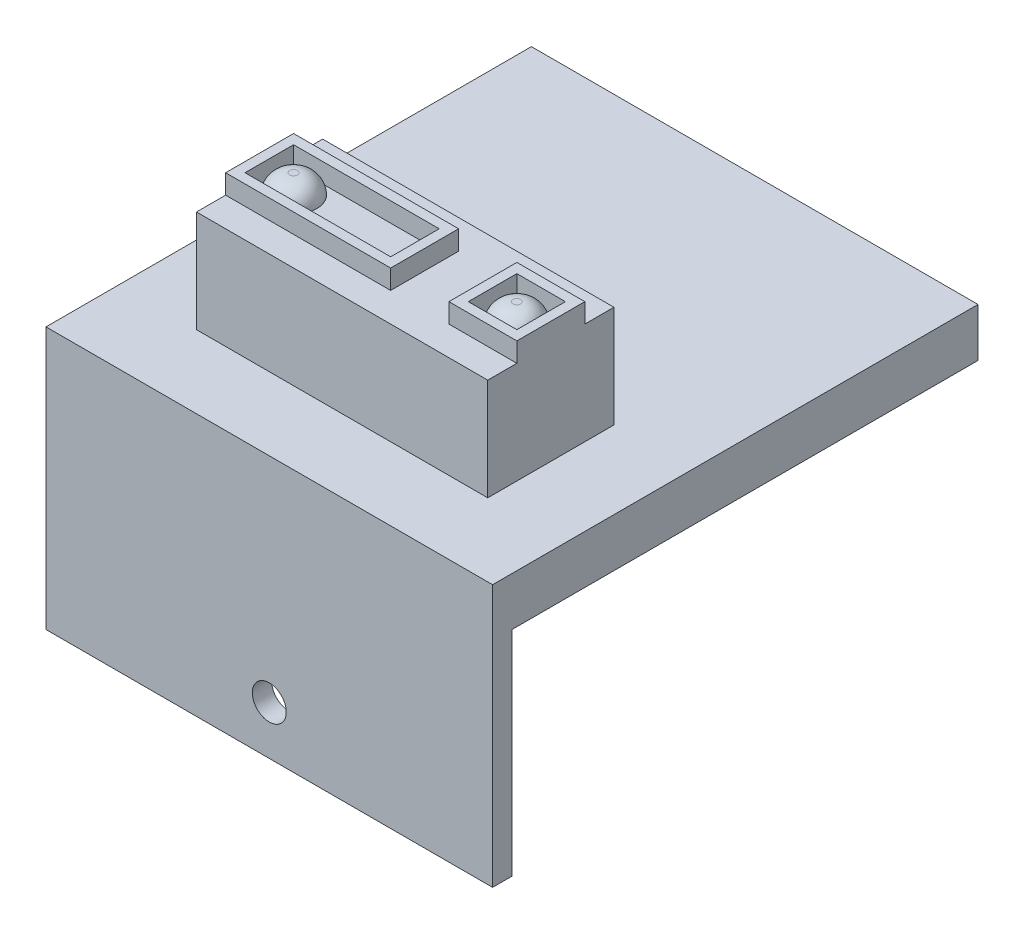
ISO-10303-21;
HEADER;
FILE_DESCRIPTION(('STEP AP214'),'2;1');
FILE_NAME('part.step','',(''),(''),'','','');
FILE_SCHEMA(('AUTOMOTIVE_DESIGN { 1 0 10303 214 1 1 1 1 }'));
ENDSEC;
DATA;
#1=APPLICATION_CONTEXT('core data for automotive mechanical design processes');
#2=APPLICATION_PROTOCOL_DEFINITION('international standard','automotive_design',2000,#1);
#3=PRODUCT_CONTEXT('',#1,'mechanical');
#4=PRODUCT('Part','Part','',(#3));
#5=PRODUCT_RELATED_PRODUCT_CATEGORY('part','',(#4));
#6=PRODUCT_DEFINITION_FORMATION('','',#4);
#7=PRODUCT_DEFINITION_CONTEXT('part definition',#1,'design');
#8=PRODUCT_DEFINITION('design','',#6,#7);
#9=PRODUCT_DEFINITION_SHAPE('','',#8);
#10=(LENGTH_UNIT() NAMED_UNIT(*) SI_UNIT(.MILLI.,.METRE.));
#11=(NAMED_UNIT(*) PLANE_ANGLE_UNIT() SI_UNIT($,.RADIAN.));
#12=(NAMED_UNIT(*) SI_UNIT($,.STERADIAN.) SOLID_ANGLE_UNIT());
#13=UNCERTAINTY_MEASURE_WITH_UNIT(LENGTH_MEASURE(1.E-05),#10,'distance_accuracy_value','');
#14=(GEOMETRIC_REPRESENTATION_CONTEXT(3) GLOBAL_UNCERTAINTY_ASSIGNED_CONTEXT((#13)) GLOBAL_UNIT_ASSIGNED_CONTEXT((#10,
#11,#12)) REPRESENTATION_CONTEXT('',''));
#15=CARTESIAN_POINT('',(0.,0.,0.));
#16=DIRECTION('',(0.,0.,1.));
#17=DIRECTION('',(1.,0.,0.));
#18=AXIS2_PLACEMENT_3D('',#15,#16,#17);
#19=CARTESIAN_POINT('',(8.,17.5,-7.5));
#20=DIRECTION('',(0.,0.,-1.));
#21=DIRECTION('',(-1.,0.,0.));
#22=AXIS2_PLACEMENT_3D('',#19,#20,#21);
#23=PLANE('',#22);
#24=DIRECTION('',(1.,0.,0.));
#25=VECTOR('',#24,1.);
#26=CARTESIAN_POINT('',(8.,15.5,-7.5));
#27=LINE('',#26,#25);
#28=CARTESIAN_POINT('',(8.,15.5,-7.5));
#29=VERTEX_POINT('',#28);
#30=CARTESIAN_POINT('',(38.,15.5,-7.5));
#31=VERTEX_POINT('',#30);
#32=EDGE_CURVE('E473',#29,#31,#27,.T.);
#33=ORIENTED_EDGE('',*,*,#32,.F.);
#34=DIRECTION('',(0.,-1.,0.));
#35=VECTOR('',#34,1.);
#36=CARTESIAN_POINT('',(8.,17.5,-7.5));
#37=LINE('',#36,#35);
#38=CARTESIAN_POINT('',(8.,5.,-7.5));
#39=VERTEX_POINT('',#38);
#40=EDGE_CURVE('E354',#29,#39,#37,.T.);
#41=ORIENTED_EDGE('',*,*,#40,.T.);
#42=DIRECTION('',(1.,0.,0.));
#43=VECTOR('',#42,1.);
#44=CARTESIAN_POINT('',(8.,5.,-7.5));
#45=LINE('',#44,#43);
#46=CARTESIAN_POINT('',(38.,5.,-7.5));
#47=VERTEX_POINT('',#46);
#48=EDGE_CURVE('E341',#39,#47,#45,.T.);
#49=ORIENTED_EDGE('',*,*,#48,.T.);
#50=DIRECTION('',(0.,-1.,0.));
#51=VECTOR('',#50,1.);
#52=CARTESIAN_POINT('',(38.,17.5,-7.5));
#53=LINE('',#52,#51);
#54=EDGE_CURVE('E352',#31,#47,#53,.T.);
#55=ORIENTED_EDGE('',*,*,#54,.F.);
#56=EDGE_LOOP('',(#33,#41,#49,#55));
#57=FACE_BOUND('',#56,.T.);
#58=ADVANCED_FACE('F40',(#57),#23,.F.);
#59=CARTESIAN_POINT('',(8.,17.5,-20.5));
#60=DIRECTION('',(0.,0.,1.));
#61=DIRECTION('',(1.,0.,0.));
#62=AXIS2_PLACEMENT_3D('',#59,#60,#61);
#63=PLANE('',#62);
#64=DIRECTION('',(-1.,0.,0.));
#65=VECTOR('',#64,1.);
#66=CARTESIAN_POINT('',(8.,15.5,-20.5));
#67=LINE('',#66,#65);
#68=CARTESIAN_POINT('',(38.,15.5,-20.5));
#69=VERTEX_POINT('',#68);
#70=CARTESIAN_POINT('',(8.,15.5,-20.5));
#71=VERTEX_POINT('',#70);
#72=EDGE_CURVE('E229',#69,#71,#67,.T.);
#73=ORIENTED_EDGE('',*,*,#72,.F.);
#74=DIRECTION('',(0.,-1.,0.));
#75=VECTOR('',#74,1.);
#76=CARTESIAN_POINT('',(38.,17.5,-20.5));
#77=LINE('',#76,#75);
#78=CARTESIAN_POINT('',(38.,5.,-20.5));
#79=VERTEX_POINT('',#78);
#80=EDGE_CURVE('E350',#69,#79,#77,.T.);
#81=ORIENTED_EDGE('',*,*,#80,.T.);
#82=DIRECTION('',(-1.,0.,0.));
#83=VECTOR('',#82,1.);
#84=CARTESIAN_POINT('',(8.,5.,-20.5));
#85=LINE('',#84,#83);
#86=CARTESIAN_POINT('',(8.,5.,-20.5));
#87=VERTEX_POINT('',#86);
#88=EDGE_CURVE('E335',#79,#87,#85,.T.);
#89=ORIENTED_EDGE('',*,*,#88,.T.);
#90=DIRECTION('',(0.,-1.,0.));
#91=VECTOR('',#90,1.);
#92=CARTESIAN_POINT('',(8.,17.5,-20.5));
#93=LINE('',#92,#91);
#94=EDGE_CURVE('E338',#71,#87,#93,.T.);
#95=ORIENTED_EDGE('',*,*,#94,.F.);
#96=EDGE_LOOP('',(#73,#81,#89,#95));
#97=FACE_BOUND('',#96,.T.);
#98=ADVANCED_FACE('F401',(#97),#63,.F.);
#99=CARTESIAN_POINT('',(0.,17.5,0.));
#100=DIRECTION('',(0.,-1.,0.));
#101=DIRECTION('',(0.,0.,-1.));
#102=AXIS2_PLACEMENT_3D('',#99,#100,#101);
#103=PLANE('',#102);
#104=DIRECTION('',(-1.,0.,0.));
#105=VECTOR('',#104,1.);
#106=CARTESIAN_POINT('',(37.,17.5,-16.5));
#107=LINE('',#106,#105);
#108=CARTESIAN_POINT('',(37.,17.5,-16.5));
#109=VERTEX_POINT('',#108);
#110=CARTESIAN_POINT('',(32.,17.5,-16.5));
#111=VERTEX_POINT('',#110);
#112=EDGE_CURVE('E261',#109,#111,#107,.T.);
#113=ORIENTED_EDGE('',*,*,#112,.F.);
#114=DIRECTION('',(0.,0.,-1.));
#115=VECTOR('',#114,1.);
#116=CARTESIAN_POINT('',(37.,17.5,-16.5));
#117=LINE('',#116,#115);
#118=CARTESIAN_POINT('',(37.,17.5,-11.5));
#119=VERTEX_POINT('',#118);
#120=EDGE_CURVE('E55',#119,#109,#117,.T.);
#121=ORIENTED_EDGE('',*,*,#120,.F.);
#122=DIRECTION('',(1.,0.,0.));
#123=VECTOR('',#122,1.);
#124=CARTESIAN_POINT('',(37.,17.5,-11.5));
#125=LINE('',#124,#123);
#126=CARTESIAN_POINT('',(32.,17.5,-11.5));
#127=VERTEX_POINT('',#126);
#128=EDGE_CURVE('E250',#127,#119,#125,.T.);
#129=ORIENTED_EDGE('',*,*,#128,.F.);
#130=DIRECTION('',(0.,0.,1.));
#131=VECTOR('',#130,1.);
#132=CARTESIAN_POINT('',(32.,17.5,-16.5));
#133=LINE('',#132,#131);
#134=EDGE_CURVE('E265',#111,#127,#133,.T.);
#135=ORIENTED_EDGE('',*,*,#134,.F.);
#136=EDGE_LOOP('',(#113,#121,#129,#135));
#137=FACE_BOUND('',#136,.T.);
#138=DIRECTION('',(0.,0.,-1.));
#139=VECTOR('',#138,1.);
#140=CARTESIAN_POINT('',(38.,17.5,-7.5));
#141=LINE('',#140,#139);
#142=CARTESIAN_POINT('',(38.,17.5,-10.5));
#143=VERTEX_POINT('',#142);
#144=CARTESIAN_POINT('',(38.,17.5,-17.5));
#145=VERTEX_POINT('',#144);
#146=EDGE_CURVE('E334',#143,#145,#141,.T.);
#147=ORIENTED_EDGE('',*,*,#146,.T.);
#148=DIRECTION('',(1.,0.,0.));
#149=VECTOR('',#148,1.);
#150=CARTESIAN_POINT('',(31.,17.5,-17.5));
#151=LINE('',#150,#149);
#152=CARTESIAN_POINT('',(31.,17.5,-17.5));
#153=VERTEX_POINT('',#152);
#154=EDGE_CURVE('E232',#153,#145,#151,.T.);
#155=ORIENTED_EDGE('',*,*,#154,.F.);
#156=DIRECTION('',(0.,0.,-1.));
#157=VECTOR('',#156,1.);
#158=CARTESIAN_POINT('',(31.,17.5,-17.5));
#159=LINE('',#158,#157);
#160=CARTESIAN_POINT('',(31.,17.5,-10.5));
#161=VERTEX_POINT('',#160);
#162=EDGE_CURVE('E508',#161,#153,#159,.T.);
#163=ORIENTED_EDGE('',*,*,#162,.F.);
#164=DIRECTION('',(-1.,0.,0.));
#165=VECTOR('',#164,1.);
#166=CARTESIAN_POINT('',(31.,17.5,-10.5));
#167=LINE('',#166,#165);
#168=EDGE_CURVE('E505',#143,#161,#167,.T.);
#169=ORIENTED_EDGE('',*,*,#168,.F.);
#170=EDGE_LOOP('',(#147,#155,#163,#169));
#171=FACE_BOUND('',#170,.T.);
#172=ADVANCED_FACE('F407',(#137,#171),#103,.F.);
#173=CARTESIAN_POINT('',(0.,5.,0.));
#174=DIRECTION('',(0.,-1.,0.));
#175=DIRECTION('',(0.,0.,-1.));
#176=AXIS2_PLACEMENT_3D('',#173,#174,#175);
#177=PLANE('',#176);
#178=DIRECTION('',(0.,0.,1.));
#179=VECTOR('',#178,1.);
#180=CARTESIAN_POINT('',(0.,5.,0.));
#181=LINE('',#180,#179);
#182=CARTESIAN_POINT('',(0.,5.,-50.));
#183=VERTEX_POINT('',#182);
#184=CARTESIAN_POINT('',(0.,5.,0.));
#185=VERTEX_POINT('',#184);
#186=EDGE_CURVE('E357',#183,#185,#181,.T.);
#187=ORIENTED_EDGE('',*,*,#186,.T.);
#188=DIRECTION('',(1.,0.,0.));
#189=VECTOR('',#188,1.);
#190=CARTESIAN_POINT('',(0.,5.,0.));
#191=LINE('',#190,#189);
#192=CARTESIAN_POINT('',(46.,5.,0.));
#193=VERTEX_POINT('',#192);
#194=EDGE_CURVE('E360',#185,#193,#191,.T.);
#195=ORIENTED_EDGE('',*,*,#194,.T.);
#196=DIRECTION('',(0.,0.,-1.));
#197=VECTOR('',#196,1.);
#198=CARTESIAN_POINT('',(46.,5.,0.));
#199=LINE('',#198,#197);
#200=CARTESIAN_POINT('',(46.,5.,-50.));
#201=VERTEX_POINT('',#200);
#202=EDGE_CURVE('E363',#193,#201,#199,.T.);
#203=ORIENTED_EDGE('',*,*,#202,.T.);
#204=DIRECTION('',(-1.,0.,0.));
#205=VECTOR('',#204,1.);
#206=CARTESIAN_POINT('',(0.,5.,-50.));
#207=LINE('',#206,#205);
#208=EDGE_CURVE('E365',#201,#183,#207,.T.);
#209=ORIENTED_EDGE('',*,*,#208,.T.);
#210=EDGE_LOOP('',(#187,#195,#203,#209));
#211=FACE_BOUND('',#210,.T.);
#212=DIRECTION('',(0.,0.,1.));
#213=VECTOR('',#212,1.);
#214=CARTESIAN_POINT('',(8.,5.,-7.5));
#215=LINE('',#214,#213);
#216=EDGE_CURVE('E332',#87,#39,#215,.T.);
#217=ORIENTED_EDGE('',*,*,#216,.F.);
#218=ORIENTED_EDGE('',*,*,#88,.F.);
#219=DIRECTION('',(0.,0.,-1.));
#220=VECTOR('',#219,1.);
#221=CARTESIAN_POINT('',(38.,5.,-7.5));
#222=LINE('',#221,#220);
#223=EDGE_CURVE('E344',#47,#79,#222,.T.);
#224=ORIENTED_EDGE('',*,*,#223,.F.);
#225=ORIENTED_EDGE('',*,*,#48,.F.);
#226=EDGE_LOOP('',(#217,#218,#224,#225));
#227=FACE_BOUND('',#226,.T.);
#228=ADVANCED_FACE('F417',(#211,#227),#177,.F.);
#229=CARTESIAN_POINT('',(0.,5.,0.));
#230=DIRECTION('',(1.,0.,0.));
#231=DIRECTION('',(0.,0.,-1.));
#232=AXIS2_PLACEMENT_3D('',#229,#230,#231);
#233=PLANE('',#232);
#234=DIRECTION('',(0.,0.,1.));
#235=VECTOR('',#234,1.);
#236=CARTESIAN_POINT('',(0.,0.,0.));
#237=LINE('',#236,#235);
#238=CARTESIAN_POINT('',(0.,0.,-50.));
#239=VERTEX_POINT('',#238);
#240=CARTESIAN_POINT('',(0.,0.,-2.));
#241=VERTEX_POINT('',#240);
#242=EDGE_CURVE('E356',#239,#241,#237,.T.);
#243=ORIENTED_EDGE('',*,*,#242,.T.);
#244=DIRECTION('',(0.,1.,0.));
#245=VECTOR('',#244,1.);
#246=CARTESIAN_POINT('',(0.,-22.,-2.));
#247=LINE('',#246,#245);
#248=CARTESIAN_POINT('',(0.,-22.,-2.));
#249=VERTEX_POINT('',#248);
#250=EDGE_CURVE('E329',#249,#241,#247,.T.);
#251=ORIENTED_EDGE('',*,*,#250,.F.);
#252=DIRECTION('',(0.,0.,-1.));
#253=VECTOR('',#252,1.);
#254=CARTESIAN_POINT('',(0.,-22.,0.));
#255=LINE('',#254,#253);
#256=CARTESIAN_POINT('',(0.,-22.,0.));
#257=VERTEX_POINT('',#256);
#258=EDGE_CURVE('E320',#257,#249,#255,.T.);
#259=ORIENTED_EDGE('',*,*,#258,.F.);
#260=DIRECTION('',(0.,-1.,0.));
#261=VECTOR('',#260,1.);
#262=CARTESIAN_POINT('',(0.,5.,0.));
#263=LINE('',#262,#261);
#264=EDGE_CURVE('E380',#185,#257,#263,.T.);
#265=ORIENTED_EDGE('',*,*,#264,.F.);
#266=ORIENTED_EDGE('',*,*,#186,.F.);
#267=DIRECTION('',(0.,-1.,0.));
#268=VECTOR('',#267,1.);
#269=CARTESIAN_POINT('',(0.,5.,-50.));
#270=LINE('',#269,#268);
#271=EDGE_CURVE('E367',#183,#239,#270,.T.);
#272=ORIENTED_EDGE('',*,*,#271,.T.);
#273=EDGE_LOOP('',(#243,#251,#259,#265,#266,#272));
#274=FACE_BOUND('',#273,.T.);
#275=ADVANCED_FACE('F420',(#274),#233,.F.);
#276=CARTESIAN_POINT('',(0.,5.,0.));
#277=DIRECTION('',(0.,0.,-1.));
#278=DIRECTION('',(-1.,0.,0.));
#279=AXIS2_PLACEMENT_3D('',#276,#277,#278);
#280=PLANE('',#279);
#281=CARTESIAN_POINT('',(23.,-17.,0.));
#282=DIRECTION('',(0.,0.,-1.));
#283=DIRECTION('',(-1.,0.,0.));
#284=AXIS2_PLACEMENT_3D('',#281,#282,#283);
#285=CIRCLE('',#284,1.75);
#286=CARTESIAN_POINT('',(21.25,-17.,0.));
#287=VERTEX_POINT('',#286);
#288=EDGE_CURVE('E310',#287,#287,#285,.T.);
#289=ORIENTED_EDGE('',*,*,#288,.T.);
#290=EDGE_LOOP('',(#289));
#291=FACE_BOUND('',#290,.T.);
#292=ORIENTED_EDGE('',*,*,#264,.T.);
#293=DIRECTION('',(-1.,0.,0.));
#294=VECTOR('',#293,1.);
#295=CARTESIAN_POINT('',(46.,-22.,0.));
#296=LINE('',#295,#294);
#297=CARTESIAN_POINT('',(46.,-22.,0.));
#298=VERTEX_POINT('',#297);
#299=EDGE_CURVE('E317',#298,#257,#296,.T.);
#300=ORIENTED_EDGE('',*,*,#299,.F.);
#301=DIRECTION('',(0.,-1.,0.));
#302=VECTOR('',#301,1.);
#303=CARTESIAN_POINT('',(46.,5.,0.));
#304=LINE('',#303,#302);
#305=EDGE_CURVE('E378',#193,#298,#304,.T.);
#306=ORIENTED_EDGE('',*,*,#305,.F.);
#307=ORIENTED_EDGE('',*,*,#194,.F.);
#308=EDGE_LOOP('',(#292,#300,#306,#307));
#309=FACE_BOUND('',#308,.T.);
#310=ADVANCED_FACE('F432',(#291,#309),#280,.F.);
#311=CARTESIAN_POINT('',(46.,5.,0.));
#312=DIRECTION('',(-1.,0.,0.));
#313=DIRECTION('',(0.,0.,1.));
#314=AXIS2_PLACEMENT_3D('',#311,#312,#313);
#315=PLANE('',#314);
#316=ORIENTED_EDGE('',*,*,#305,.T.);
#317=DIRECTION('',(0.,0.,1.));
#318=VECTOR('',#317,1.);
#319=CARTESIAN_POINT('',(46.,-22.,0.));
#320=LINE('',#319,#318);
#321=CARTESIAN_POINT('',(46.,-22.,-2.));
#322=VERTEX_POINT('',#321);
#323=EDGE_CURVE('E314',#322,#298,#320,.T.);
#324=ORIENTED_EDGE('',*,*,#323,.F.);
#325=DIRECTION('',(0.,1.,0.));
#326=VECTOR('',#325,1.);
#327=CARTESIAN_POINT('',(46.,-22.,-2.));
#328=LINE('',#327,#326);
#329=CARTESIAN_POINT('',(46.,0.,-2.));
#330=VERTEX_POINT('',#329);
#331=EDGE_CURVE('E324',#322,#330,#328,.T.);
#332=ORIENTED_EDGE('',*,*,#331,.T.);
#333=DIRECTION('',(0.,0.,-1.));
#334=VECTOR('',#333,1.);
#335=CARTESIAN_POINT('',(46.,0.,0.));
#336=LINE('',#335,#334);
#337=CARTESIAN_POINT('',(46.,0.,-50.));
#338=VERTEX_POINT('',#337);
#339=EDGE_CURVE('E370',#330,#338,#336,.T.);
#340=ORIENTED_EDGE('',*,*,#339,.T.);
#341=DIRECTION('',(0.,-1.,0.));
#342=VECTOR('',#341,1.);
#343=CARTESIAN_POINT('',(46.,5.,-50.));
#344=LINE('',#343,#342);
#345=EDGE_CURVE('E375',#201,#338,#344,.T.);
#346=ORIENTED_EDGE('',*,*,#345,.F.);
#347=ORIENTED_EDGE('',*,*,#202,.F.);
#348=EDGE_LOOP('',(#316,#324,#332,#340,#346,#347));
#349=FACE_BOUND('',#348,.T.);
#350=ADVANCED_FACE('F428',(#349),#315,.F.);
#351=CARTESIAN_POINT('',(0.,5.,-50.));
#352=DIRECTION('',(0.,0.,1.));
#353=DIRECTION('',(1.,0.,0.));
#354=AXIS2_PLACEMENT_3D('',#351,#352,#353);
#355=PLANE('',#354);
#356=DIRECTION('',(-1.,0.,0.));
#357=VECTOR('',#356,1.);
#358=CARTESIAN_POINT('',(0.,0.,-50.));
#359=LINE('',#358,#357);
#360=EDGE_CURVE('E361',#338,#239,#359,.T.);
#361=ORIENTED_EDGE('',*,*,#360,.T.);
#362=ORIENTED_EDGE('',*,*,#271,.F.);
#363=ORIENTED_EDGE('',*,*,#208,.F.);
#364=ORIENTED_EDGE('',*,*,#345,.T.);
#365=EDGE_LOOP('',(#361,#362,#363,#364));
#366=FACE_BOUND('',#365,.T.);
#367=ADVANCED_FACE('F424',(#366),#355,.F.);
#368=CARTESIAN_POINT('',(0.,0.,0.));
#369=DIRECTION('',(0.,-1.,0.));
#370=DIRECTION('',(0.,0.,-1.));
#371=AXIS2_PLACEMENT_3D('',#368,#369,#370);
#372=PLANE('',#371);
#373=DIRECTION('',(1.,0.,0.));
#374=VECTOR('',#373,1.);
#375=CARTESIAN_POINT('',(46.,0.,-2.));
#376=LINE('',#375,#374);
#377=EDGE_CURVE('E313',#241,#330,#376,.T.);
#378=ORIENTED_EDGE('',*,*,#377,.F.);
#379=ORIENTED_EDGE('',*,*,#242,.F.);
#380=ORIENTED_EDGE('',*,*,#360,.F.);
#381=ORIENTED_EDGE('',*,*,#339,.F.);
#382=EDGE_LOOP('',(#378,#379,#380,#381));
#383=FACE_BOUND('',#382,.T.);
#384=ADVANCED_FACE('F416',(#383),#372,.T.);
#385=CARTESIAN_POINT('',(8.,17.5,-7.5));
#386=DIRECTION('',(1.,0.,0.));
#387=DIRECTION('',(0.,0.,-1.));
#388=AXIS2_PLACEMENT_3D('',#385,#386,#387);
#389=PLANE('',#388);
#390=DIRECTION('',(0.,0.,1.));
#391=VECTOR('',#390,1.);
#392=CARTESIAN_POINT('',(8.,17.5,-7.5));
#393=LINE('',#392,#391);
#394=CARTESIAN_POINT('',(8.,17.5,-17.5));
#395=VERTEX_POINT('',#394);
#396=CARTESIAN_POINT('',(8.,17.5,-10.5));
#397=VERTEX_POINT('',#396);
#398=EDGE_CURVE('E238',#395,#397,#393,.T.);
#399=ORIENTED_EDGE('',*,*,#398,.F.);
#400=DIRECTION('',(0.,1.,0.));
#401=VECTOR('',#400,1.);
#402=CARTESIAN_POINT('',(8.,15.5,-17.5));
#403=LINE('',#402,#401);
#404=CARTESIAN_POINT('',(8.,15.5,-17.5));
#405=VERTEX_POINT('',#404);
#406=EDGE_CURVE('E217',#405,#395,#403,.T.);
#407=ORIENTED_EDGE('',*,*,#406,.F.);
#408=DIRECTION('',(0.,0.,1.));
#409=VECTOR('',#408,1.);
#410=CARTESIAN_POINT('',(8.,15.5,-20.5));
#411=LINE('',#410,#409);
#412=EDGE_CURVE('E224',#71,#405,#411,.T.);
#413=ORIENTED_EDGE('',*,*,#412,.F.);
#414=ORIENTED_EDGE('',*,*,#94,.T.);
#415=ORIENTED_EDGE('',*,*,#216,.T.);
#416=ORIENTED_EDGE('',*,*,#40,.F.);
#417=DIRECTION('',(0.,0.,1.));
#418=VECTOR('',#417,1.);
#419=CARTESIAN_POINT('',(8.,15.5,-7.5));
#420=LINE('',#419,#418);
#421=CARTESIAN_POINT('',(8.,15.5,-10.5));
#422=VERTEX_POINT('',#421);
#423=EDGE_CURVE('E475',#422,#29,#420,.T.);
#424=ORIENTED_EDGE('',*,*,#423,.F.);
#425=DIRECTION('',(0.,1.,0.));
#426=VECTOR('',#425,1.);
#427=CARTESIAN_POINT('',(8.,15.5,-10.5));
#428=LINE('',#427,#426);
#429=EDGE_CURVE('E476',#422,#397,#428,.T.);
#430=ORIENTED_EDGE('',*,*,#429,.T.);
#431=EDGE_LOOP('',(#399,#407,#413,#414,#415,#416,#424,#430));
#432=FACE_BOUND('',#431,.T.);
#433=ADVANCED_FACE('F235',(#432),#389,.F.);
#434=CARTESIAN_POINT('',(38.,17.5,-7.5));
#435=DIRECTION('',(-1.,0.,0.));
#436=DIRECTION('',(0.,0.,1.));
#437=AXIS2_PLACEMENT_3D('',#434,#435,#436);
#438=PLANE('',#437);
#439=ORIENTED_EDGE('',*,*,#146,.F.);
#440=DIRECTION('',(0.,1.,0.));
#441=VECTOR('',#440,1.);
#442=CARTESIAN_POINT('',(38.,15.5,-10.5));
#443=LINE('',#442,#441);
#444=CARTESIAN_POINT('',(38.,15.5,-10.5));
#445=VERTEX_POINT('',#444);
#446=EDGE_CURVE('E517',#445,#143,#443,.T.);
#447=ORIENTED_EDGE('',*,*,#446,.F.);
#448=DIRECTION('',(0.,0.,-1.));
#449=VECTOR('',#448,1.);
#450=CARTESIAN_POINT('',(38.,15.5,-7.5));
#451=LINE('',#450,#449);
#452=EDGE_CURVE('E480',#31,#445,#451,.T.);
#453=ORIENTED_EDGE('',*,*,#452,.F.);
#454=ORIENTED_EDGE('',*,*,#54,.T.);
#455=ORIENTED_EDGE('',*,*,#223,.T.);
#456=ORIENTED_EDGE('',*,*,#80,.F.);
#457=DIRECTION('',(0.,0.,-1.));
#458=VECTOR('',#457,1.);
#459=CARTESIAN_POINT('',(38.,15.5,-20.5));
#460=LINE('',#459,#458);
#461=CARTESIAN_POINT('',(38.,15.5,-17.5));
#462=VERTEX_POINT('',#461);
#463=EDGE_CURVE('E242',#462,#69,#460,.T.);
#464=ORIENTED_EDGE('',*,*,#463,.F.);
#465=DIRECTION('',(0.,1.,0.));
#466=VECTOR('',#465,1.);
#467=CARTESIAN_POINT('',(38.,15.5,-17.5));
#468=LINE('',#467,#466);
#469=EDGE_CURVE('E262',#462,#145,#468,.T.);
#470=ORIENTED_EDGE('',*,*,#469,.T.);
#471=EDGE_LOOP('',(#439,#447,#453,#454,#455,#456,#464,#470));
#472=FACE_BOUND('',#471,.T.);
#473=ADVANCED_FACE('F413',(#472),#438,.F.);
#474=DIRECTION('',(1.,0.,0.));
#475=VECTOR('',#474,1.);
#476=CARTESIAN_POINT('',(9.,17.5,-11.5));
#477=LINE('',#476,#475);
#478=CARTESIAN_POINT('',(9.,17.5,-11.5));
#479=VERTEX_POINT('',#478);
#480=CARTESIAN_POINT('',(24.,17.5,-11.5));
#481=VERTEX_POINT('',#480);
#482=EDGE_CURVE('E292',#479,#481,#477,.T.);
#483=ORIENTED_EDGE('',*,*,#482,.F.);
#484=DIRECTION('',(0.,0.,1.));
#485=VECTOR('',#484,1.);
#486=CARTESIAN_POINT('',(9.,17.5,-16.5));
#487=LINE('',#486,#485);
#488=CARTESIAN_POINT('',(9.,17.5,-16.5));
#489=VERTEX_POINT('',#488);
#490=EDGE_CURVE('E63',#489,#479,#487,.T.);
#491=ORIENTED_EDGE('',*,*,#490,.F.);
#492=DIRECTION('',(-1.,0.,0.));
#493=VECTOR('',#492,1.);
#494=CARTESIAN_POINT('',(9.,17.5,-16.5));
#495=LINE('',#494,#493);
#496=CARTESIAN_POINT('',(24.,17.5,-16.5));
#497=VERTEX_POINT('',#496);
#498=EDGE_CURVE('E281',#497,#489,#495,.T.);
#499=ORIENTED_EDGE('',*,*,#498,.F.);
#500=DIRECTION('',(0.,0.,-1.));
#501=VECTOR('',#500,1.);
#502=CARTESIAN_POINT('',(24.,17.5,-16.5));
#503=LINE('',#502,#501);
#504=EDGE_CURVE('E295',#481,#497,#503,.T.);
#505=ORIENTED_EDGE('',*,*,#504,.F.);
#506=EDGE_LOOP('',(#483,#491,#499,#505));
#507=FACE_BOUND('',#506,.T.);
#508=ORIENTED_EDGE('',*,*,#398,.T.);
#509=DIRECTION('',(-1.,0.,0.));
#510=VECTOR('',#509,1.);
#511=CARTESIAN_POINT('',(8.,17.5,-10.5));
#512=LINE('',#511,#510);
#513=CARTESIAN_POINT('',(25.,17.5,-10.5));
#514=VERTEX_POINT('',#513);
#515=EDGE_CURVE('E503',#514,#397,#512,.T.);
#516=ORIENTED_EDGE('',*,*,#515,.F.);
#517=DIRECTION('',(0.,0.,1.));
#518=VECTOR('',#517,1.);
#519=CARTESIAN_POINT('',(25.,17.5,-17.5));
#520=LINE('',#519,#518);
#521=CARTESIAN_POINT('',(25.,17.5,-17.5));
#522=VERTEX_POINT('',#521);
#523=EDGE_CURVE('E499',#522,#514,#520,.T.);
#524=ORIENTED_EDGE('',*,*,#523,.F.);
#525=DIRECTION('',(1.,0.,0.));
#526=VECTOR('',#525,1.);
#527=CARTESIAN_POINT('',(8.,17.5,-17.5));
#528=LINE('',#527,#526);
#529=EDGE_CURVE('E497',#395,#522,#528,.T.);
#530=ORIENTED_EDGE('',*,*,#529,.F.);
#531=EDGE_LOOP('',(#508,#516,#524,#530));
#532=FACE_BOUND('',#531,.T.);
#533=ADVANCED_FACE('F527',(#507,#532),#103,.F.);
#534=CARTESIAN_POINT('',(46.,-22.,-2.));
#535=DIRECTION('',(0.,0.,1.));
#536=DIRECTION('',(1.,0.,0.));
#537=AXIS2_PLACEMENT_3D('',#534,#535,#536);
#538=PLANE('',#537);
#539=CARTESIAN_POINT('',(23.,-17.,-2.));
#540=DIRECTION('',(0.,0.,-1.));
#541=DIRECTION('',(-1.,0.,0.));
#542=AXIS2_PLACEMENT_3D('',#539,#540,#541);
#543=CIRCLE('',#542,1.75);
#544=CARTESIAN_POINT('',(21.25,-17.,-2.));
#545=VERTEX_POINT('',#544);
#546=EDGE_CURVE('E302',#545,#545,#543,.T.);
#547=ORIENTED_EDGE('',*,*,#546,.F.);
#548=EDGE_LOOP('',(#547));
#549=FACE_BOUND('',#548,.T.);
#550=ORIENTED_EDGE('',*,*,#377,.T.);
#551=ORIENTED_EDGE('',*,*,#331,.F.);
#552=DIRECTION('',(1.,0.,0.));
#553=VECTOR('',#552,1.);
#554=CARTESIAN_POINT('',(46.,-22.,-2.));
#555=LINE('',#554,#553);
#556=EDGE_CURVE('E322',#249,#322,#555,.T.);
#557=ORIENTED_EDGE('',*,*,#556,.F.);
#558=ORIENTED_EDGE('',*,*,#250,.T.);
#559=EDGE_LOOP('',(#550,#551,#557,#558));
#560=FACE_BOUND('',#559,.T.);
#561=ADVANCED_FACE('F448',(#549,#560),#538,.F.);
#562=CARTESIAN_POINT('',(0.,-22.,0.));
#563=DIRECTION('',(0.,1.,0.));
#564=DIRECTION('',(0.,0.,1.));
#565=AXIS2_PLACEMENT_3D('',#562,#563,#564);
#566=PLANE('',#565);
#567=ORIENTED_EDGE('',*,*,#323,.T.);
#568=ORIENTED_EDGE('',*,*,#299,.T.);
#569=ORIENTED_EDGE('',*,*,#258,.T.);
#570=ORIENTED_EDGE('',*,*,#556,.T.);
#571=EDGE_LOOP('',(#567,#568,#569,#570));
#572=FACE_BOUND('',#571,.T.);
#573=ADVANCED_FACE('F452',(#572),#566,.F.);
#574=CARTESIAN_POINT('',(23.,-17.,20.));
#575=DIRECTION('',(0.,0.,-1.));
#576=DIRECTION('',(-1.,0.,0.));
#577=AXIS2_PLACEMENT_3D('',#574,#575,#576);
#578=CYLINDRICAL_SURFACE('',#577,1.75);
#579=ORIENTED_EDGE('',*,*,#546,.T.);
#580=EDGE_LOOP('',(#579));
#581=FACE_BOUND('',#580,.T.);
#582=ORIENTED_EDGE('',*,*,#288,.F.);
#583=EDGE_LOOP('',(#582));
#584=FACE_BOUND('',#583,.T.);
#585=ADVANCED_FACE('F609',(#581,#584),#578,.F.);
#586=CARTESIAN_POINT('',(9.,15.5,-16.5));
#587=DIRECTION('',(-1.,0.,0.));
#588=DIRECTION('',(0.,0.,1.));
#589=AXIS2_PLACEMENT_3D('',#586,#587,#588);
#590=PLANE('',#589);
#591=ORIENTED_EDGE('',*,*,#490,.T.);
#592=DIRECTION('',(0.,1.,0.));
#593=VECTOR('',#592,1.);
#594=CARTESIAN_POINT('',(9.,15.5,-11.5));
#595=LINE('',#594,#593);
#596=CARTESIAN_POINT('',(9.,15.5,-11.5));
#597=VERTEX_POINT('',#596);
#598=EDGE_CURVE('E290',#597,#479,#595,.T.);
#599=ORIENTED_EDGE('',*,*,#598,.F.);
#600=DIRECTION('',(0.,0.,1.));
#601=VECTOR('',#600,1.);
#602=CARTESIAN_POINT('',(9.,15.5,-16.5));
#603=LINE('',#602,#601);
#604=CARTESIAN_POINT('',(9.,15.5,-16.5));
#605=VERTEX_POINT('',#604);
#606=EDGE_CURVE('E277',#605,#597,#603,.T.);
#607=ORIENTED_EDGE('',*,*,#606,.F.);
#608=DIRECTION('',(0.,1.,0.));
#609=VECTOR('',#608,1.);
#610=CARTESIAN_POINT('',(9.,15.5,-16.5));
#611=LINE('',#610,#609);
#612=EDGE_CURVE('E300',#605,#489,#611,.T.);
#613=ORIENTED_EDGE('',*,*,#612,.T.);
#614=EDGE_LOOP('',(#591,#599,#607,#613));
#615=FACE_BOUND('',#614,.T.);
#616=ADVANCED_FACE('F599',(#615),#590,.F.);
#617=CARTESIAN_POINT('',(9.,15.5,-16.5));
#618=DIRECTION('',(0.,0.,-1.));
#619=DIRECTION('',(-1.,0.,0.));
#620=AXIS2_PLACEMENT_3D('',#617,#618,#619);
#621=PLANE('',#620);
#622=ORIENTED_EDGE('',*,*,#498,.T.);
#623=ORIENTED_EDGE('',*,*,#612,.F.);
#624=DIRECTION('',(-1.,0.,0.));
#625=VECTOR('',#624,1.);
#626=CARTESIAN_POINT('',(9.,15.5,-16.5));
#627=LINE('',#626,#625);
#628=CARTESIAN_POINT('',(24.,15.5,-16.5));
#629=VERTEX_POINT('',#628);
#630=EDGE_CURVE('E287',#629,#605,#627,.T.);
#631=ORIENTED_EDGE('',*,*,#630,.F.);
#632=DIRECTION('',(0.,1.,0.));
#633=VECTOR('',#632,1.);
#634=CARTESIAN_POINT('',(24.,15.5,-16.5));
#635=LINE('',#634,#633);
#636=EDGE_CURVE('E303',#629,#497,#635,.T.);
#637=ORIENTED_EDGE('',*,*,#636,.T.);
#638=EDGE_LOOP('',(#622,#623,#631,#637));
#639=FACE_BOUND('',#638,.T.);
#640=ADVANCED_FACE('F595',(#639),#621,.F.);
#641=CARTESIAN_POINT('',(24.,15.5,-16.5));
#642=DIRECTION('',(1.,0.,0.));
#643=DIRECTION('',(0.,0.,-1.));
#644=AXIS2_PLACEMENT_3D('',#641,#642,#643);
#645=PLANE('',#644);
#646=ORIENTED_EDGE('',*,*,#504,.T.);
#647=ORIENTED_EDGE('',*,*,#636,.F.);
#648=DIRECTION('',(0.,0.,-1.));
#649=VECTOR('',#648,1.);
#650=CARTESIAN_POINT('',(24.,15.5,-16.5));
#651=LINE('',#650,#649);
#652=CARTESIAN_POINT('',(24.,15.5,-11.5));
#653=VERTEX_POINT('',#652);
#654=EDGE_CURVE('E284',#653,#629,#651,.T.);
#655=ORIENTED_EDGE('',*,*,#654,.F.);
#656=DIRECTION('',(0.,1.,0.));
#657=VECTOR('',#656,1.);
#658=CARTESIAN_POINT('',(24.,15.5,-11.5));
#659=LINE('',#658,#657);
#660=EDGE_CURVE('E305',#653,#481,#659,.T.);
#661=ORIENTED_EDGE('',*,*,#660,.T.);
#662=EDGE_LOOP('',(#646,#647,#655,#661));
#663=FACE_BOUND('',#662,.T.);
#664=ADVANCED_FACE('F598',(#663),#645,.F.);
#665=CARTESIAN_POINT('',(9.,15.5,-11.5));
#666=DIRECTION('',(0.,0.,1.));
#667=DIRECTION('',(1.,0.,0.));
#668=AXIS2_PLACEMENT_3D('',#665,#666,#667);
#669=PLANE('',#668);
#670=ORIENTED_EDGE('',*,*,#482,.T.);
#671=ORIENTED_EDGE('',*,*,#660,.F.);
#672=DIRECTION('',(1.,0.,0.));
#673=VECTOR('',#672,1.);
#674=CARTESIAN_POINT('',(9.,15.5,-11.5));
#675=LINE('',#674,#673);
#676=EDGE_CURVE('E280',#597,#653,#675,.T.);
#677=ORIENTED_EDGE('',*,*,#676,.F.);
#678=ORIENTED_EDGE('',*,*,#598,.T.);
#679=EDGE_LOOP('',(#670,#671,#677,#678));
#680=FACE_BOUND('',#679,.T.);
#681=ADVANCED_FACE('F593',(#680),#669,.F.);
#682=CARTESIAN_POINT('',(0.,15.5,0.));
#683=DIRECTION('',(0.,1.,0.));
#684=DIRECTION('',(0.,0.,1.));
#685=AXIS2_PLACEMENT_3D('',#682,#683,#684);
#686=PLANE('',#685);
#687=CARTESIAN_POINT('',(11.5,15.5,-14.));
#688=DIRECTION('',(0.,1.,0.));
#689=DIRECTION('',(0.,0.,1.));
#690=AXIS2_PLACEMENT_3D('',#687,#688,#689);
#691=CIRCLE('',#690,2.4);
#692=CARTESIAN_POINT('',(11.5,15.5,-11.6));
#693=VERTEX_POINT('',#692);
#694=EDGE_CURVE('E500',#693,#693,#691,.T.);
#695=ORIENTED_EDGE('',*,*,#694,.F.);
#696=EDGE_LOOP('',(#695));
#697=FACE_BOUND('',#696,.T.);
#698=ORIENTED_EDGE('',*,*,#606,.T.);
#699=ORIENTED_EDGE('',*,*,#676,.T.);
#700=ORIENTED_EDGE('',*,*,#654,.T.);
#701=ORIENTED_EDGE('',*,*,#630,.T.);
#702=EDGE_LOOP('',(#698,#699,#700,#701));
#703=FACE_BOUND('',#702,.T.);
#704=ADVANCED_FACE('F590',(#697,#703),#686,.T.);
#705=CARTESIAN_POINT('',(31.,15.5,-17.5));
#706=DIRECTION('',(0.,0.,1.));
#707=DIRECTION('',(1.,0.,0.));
#708=AXIS2_PLACEMENT_3D('',#705,#706,#707);
#709=PLANE('',#708);
#710=ORIENTED_EDGE('',*,*,#154,.T.);
#711=ORIENTED_EDGE('',*,*,#469,.F.);
#712=DIRECTION('',(1.,0.,0.));
#713=VECTOR('',#712,1.);
#714=CARTESIAN_POINT('',(31.,15.5,-17.5));
#715=LINE('',#714,#713);
#716=CARTESIAN_POINT('',(31.,15.5,-17.5));
#717=VERTEX_POINT('',#716);
#718=EDGE_CURVE('E493',#717,#462,#715,.T.);
#719=ORIENTED_EDGE('',*,*,#718,.F.);
#720=DIRECTION('',(0.,1.,0.));
#721=VECTOR('',#720,1.);
#722=CARTESIAN_POINT('',(31.,15.5,-17.5));
#723=LINE('',#722,#721);
#724=EDGE_CURVE('E513',#717,#153,#723,.T.);
#725=ORIENTED_EDGE('',*,*,#724,.T.);
#726=EDGE_LOOP('',(#710,#711,#719,#725));
#727=FACE_BOUND('',#726,.T.);
#728=ADVANCED_FACE('F551',(#727),#709,.F.);
#729=CARTESIAN_POINT('',(31.,15.5,-17.5));
#730=DIRECTION('',(1.,0.,0.));
#731=DIRECTION('',(0.,0.,-1.));
#732=AXIS2_PLACEMENT_3D('',#729,#730,#731);
#733=PLANE('',#732);
#734=ORIENTED_EDGE('',*,*,#162,.T.);
#735=ORIENTED_EDGE('',*,*,#724,.F.);
#736=DIRECTION('',(0.,0.,-1.));
#737=VECTOR('',#736,1.);
#738=CARTESIAN_POINT('',(31.,15.5,-17.5));
#739=LINE('',#738,#737);
#740=CARTESIAN_POINT('',(31.,15.5,-10.5));
#741=VERTEX_POINT('',#740);
#742=EDGE_CURVE('E490',#741,#717,#739,.T.);
#743=ORIENTED_EDGE('',*,*,#742,.F.);
#744=DIRECTION('',(0.,1.,0.));
#745=VECTOR('',#744,1.);
#746=CARTESIAN_POINT('',(31.,15.5,-10.5));
#747=LINE('',#746,#745);
#748=EDGE_CURVE('E515',#741,#161,#747,.T.);
#749=ORIENTED_EDGE('',*,*,#748,.T.);
#750=EDGE_LOOP('',(#734,#735,#743,#749));
#751=FACE_BOUND('',#750,.T.);
#752=ADVANCED_FACE('F554',(#751),#733,.F.);
#753=CARTESIAN_POINT('',(31.,15.5,-10.5));
#754=DIRECTION('',(0.,0.,-1.));
#755=DIRECTION('',(-1.,0.,0.));
#756=AXIS2_PLACEMENT_3D('',#753,#754,#755);
#757=PLANE('',#756);
#758=ORIENTED_EDGE('',*,*,#168,.T.);
#759=ORIENTED_EDGE('',*,*,#748,.F.);
#760=DIRECTION('',(-1.,0.,0.));
#761=VECTOR('',#760,1.);
#762=CARTESIAN_POINT('',(31.,15.5,-10.5));
#763=LINE('',#762,#761);
#764=EDGE_CURVE('E487',#445,#741,#763,.T.);
#765=ORIENTED_EDGE('',*,*,#764,.F.);
#766=ORIENTED_EDGE('',*,*,#446,.T.);
#767=EDGE_LOOP('',(#758,#759,#765,#766));
#768=FACE_BOUND('',#767,.T.);
#769=ADVANCED_FACE('F556',(#768),#757,.F.);
#770=CARTESIAN_POINT('',(8.,15.5,-10.5));
#771=DIRECTION('',(0.,0.,-1.));
#772=DIRECTION('',(-1.,0.,0.));
#773=AXIS2_PLACEMENT_3D('',#770,#771,#772);
#774=PLANE('',#773);
#775=ORIENTED_EDGE('',*,*,#515,.T.);
#776=ORIENTED_EDGE('',*,*,#429,.F.);
#777=DIRECTION('',(-1.,0.,0.));
#778=VECTOR('',#777,1.);
#779=CARTESIAN_POINT('',(8.,15.5,-10.5));
#780=LINE('',#779,#778);
#781=CARTESIAN_POINT('',(25.,15.5,-10.5));
#782=VERTEX_POINT('',#781);
#783=EDGE_CURVE('E478',#782,#422,#780,.T.);
#784=ORIENTED_EDGE('',*,*,#783,.F.);
#785=DIRECTION('',(0.,1.,0.));
#786=VECTOR('',#785,1.);
#787=CARTESIAN_POINT('',(25.,15.5,-10.5));
#788=LINE('',#787,#786);
#789=EDGE_CURVE('E240',#782,#514,#788,.T.);
#790=ORIENTED_EDGE('',*,*,#789,.T.);
#791=EDGE_LOOP('',(#775,#776,#784,#790));
#792=FACE_BOUND('',#791,.T.);
#793=ADVANCED_FACE('F521',(#792),#774,.F.);
#794=CARTESIAN_POINT('',(25.,15.5,-17.5));
#795=DIRECTION('',(-1.,0.,0.));
#796=DIRECTION('',(0.,0.,1.));
#797=AXIS2_PLACEMENT_3D('',#794,#795,#796);
#798=PLANE('',#797);
#799=ORIENTED_EDGE('',*,*,#523,.T.);
#800=ORIENTED_EDGE('',*,*,#789,.F.);
#801=DIRECTION('',(0.,0.,1.));
#802=VECTOR('',#801,1.);
#803=CARTESIAN_POINT('',(25.,15.5,-17.5));
#804=LINE('',#803,#802);
#805=CARTESIAN_POINT('',(25.,15.5,-17.5));
#806=VERTEX_POINT('',#805);
#807=EDGE_CURVE('E223',#806,#782,#804,.T.);
#808=ORIENTED_EDGE('',*,*,#807,.F.);
#809=DIRECTION('',(0.,1.,0.));
#810=VECTOR('',#809,1.);
#811=CARTESIAN_POINT('',(25.,15.5,-17.5));
#812=LINE('',#811,#810);
#813=EDGE_CURVE('E219',#806,#522,#812,.T.);
#814=ORIENTED_EDGE('',*,*,#813,.T.);
#815=EDGE_LOOP('',(#799,#800,#808,#814));
#816=FACE_BOUND('',#815,.T.);
#817=ADVANCED_FACE('F525',(#816),#798,.F.);
#818=CARTESIAN_POINT('',(8.,15.5,-17.5));
#819=DIRECTION('',(0.,0.,1.));
#820=DIRECTION('',(1.,0.,0.));
#821=AXIS2_PLACEMENT_3D('',#818,#819,#820);
#822=PLANE('',#821);
#823=ORIENTED_EDGE('',*,*,#529,.T.);
#824=ORIENTED_EDGE('',*,*,#813,.F.);
#825=DIRECTION('',(1.,0.,0.));
#826=VECTOR('',#825,1.);
#827=CARTESIAN_POINT('',(8.,15.5,-17.5));
#828=LINE('',#827,#826);
#829=EDGE_CURVE('E212',#405,#806,#828,.T.);
#830=ORIENTED_EDGE('',*,*,#829,.F.);
#831=ORIENTED_EDGE('',*,*,#406,.T.);
#832=EDGE_LOOP('',(#823,#824,#830,#831));
#833=FACE_BOUND('',#832,.T.);
#834=ADVANCED_FACE('F215',(#833),#822,.F.);
#835=CARTESIAN_POINT('',(0.,15.5,0.));
#836=DIRECTION('',(0.,1.,0.));
#837=DIRECTION('',(0.,0.,1.));
#838=AXIS2_PLACEMENT_3D('',#835,#836,#837);
#839=PLANE('',#838);
#840=ORIENTED_EDGE('',*,*,#412,.T.);
#841=ORIENTED_EDGE('',*,*,#829,.T.);
#842=ORIENTED_EDGE('',*,*,#807,.T.);
#843=ORIENTED_EDGE('',*,*,#783,.T.);
#844=ORIENTED_EDGE('',*,*,#423,.T.);
#845=ORIENTED_EDGE('',*,*,#32,.T.);
#846=ORIENTED_EDGE('',*,*,#452,.T.);
#847=ORIENTED_EDGE('',*,*,#764,.T.);
#848=ORIENTED_EDGE('',*,*,#742,.T.);
#849=ORIENTED_EDGE('',*,*,#718,.T.);
#850=ORIENTED_EDGE('',*,*,#463,.T.);
#851=ORIENTED_EDGE('',*,*,#72,.T.);
#852=EDGE_LOOP('',(#840,#841,#842,#843,#844,#845,#846,#847,#848,#849,#850,#851));
#853=FACE_BOUND('',#852,.T.);
#854=ADVANCED_FACE('F227',(#853),#839,.T.);
#855=CARTESIAN_POINT('',(37.,15.5,-16.5));
#856=DIRECTION('',(1.,0.,0.));
#857=DIRECTION('',(0.,0.,-1.));
#858=AXIS2_PLACEMENT_3D('',#855,#856,#857);
#859=PLANE('',#858);
#860=ORIENTED_EDGE('',*,*,#120,.T.);
#861=DIRECTION('',(0.,1.,0.));
#862=VECTOR('',#861,1.);
#863=CARTESIAN_POINT('',(37.,15.5,-16.5));
#864=LINE('',#863,#862);
#865=CARTESIAN_POINT('',(37.,15.5,-16.5));
#866=VERTEX_POINT('',#865);
#867=EDGE_CURVE('E259',#866,#109,#864,.T.);
#868=ORIENTED_EDGE('',*,*,#867,.F.);
#869=DIRECTION('',(0.,0.,-1.));
#870=VECTOR('',#869,1.);
#871=CARTESIAN_POINT('',(37.,15.5,-16.5));
#872=LINE('',#871,#870);
#873=CARTESIAN_POINT('',(37.,15.5,-11.5));
#874=VERTEX_POINT('',#873);
#875=EDGE_CURVE('E246',#874,#866,#872,.T.);
#876=ORIENTED_EDGE('',*,*,#875,.F.);
#877=DIRECTION('',(0.,1.,0.));
#878=VECTOR('',#877,1.);
#879=CARTESIAN_POINT('',(37.,15.5,-11.5));
#880=LINE('',#879,#878);
#881=EDGE_CURVE('E270',#874,#119,#880,.T.);
#882=ORIENTED_EDGE('',*,*,#881,.T.);
#883=EDGE_LOOP('',(#860,#868,#876,#882));
#884=FACE_BOUND('',#883,.T.);
#885=ADVANCED_FACE('F580',(#884),#859,.F.);
#886=CARTESIAN_POINT('',(37.,15.5,-11.5));
#887=DIRECTION('',(0.,0.,1.));
#888=DIRECTION('',(1.,0.,0.));
#889=AXIS2_PLACEMENT_3D('',#886,#887,#888);
#890=PLANE('',#889);
#891=ORIENTED_EDGE('',*,*,#128,.T.);
#892=ORIENTED_EDGE('',*,*,#881,.F.);
#893=DIRECTION('',(1.,0.,0.));
#894=VECTOR('',#893,1.);
#895=CARTESIAN_POINT('',(37.,15.5,-11.5));
#896=LINE('',#895,#894);
#897=CARTESIAN_POINT('',(32.,15.5,-11.5));
#898=VERTEX_POINT('',#897);
#899=EDGE_CURVE('E256',#898,#874,#896,.T.);
#900=ORIENTED_EDGE('',*,*,#899,.F.);
#901=DIRECTION('',(0.,1.,0.));
#902=VECTOR('',#901,1.);
#903=CARTESIAN_POINT('',(32.,15.5,-11.5));
#904=LINE('',#903,#902);
#905=EDGE_CURVE('E272',#898,#127,#904,.T.);
#906=ORIENTED_EDGE('',*,*,#905,.T.);
#907=EDGE_LOOP('',(#891,#892,#900,#906));
#908=FACE_BOUND('',#907,.T.);
#909=ADVANCED_FACE('F576',(#908),#890,.F.);
#910=CARTESIAN_POINT('',(32.,15.5,-16.5));
#911=DIRECTION('',(-1.,0.,0.));
#912=DIRECTION('',(0.,0.,1.));
#913=AXIS2_PLACEMENT_3D('',#910,#911,#912);
#914=PLANE('',#913);
#915=ORIENTED_EDGE('',*,*,#134,.T.);
#916=ORIENTED_EDGE('',*,*,#905,.F.);
#917=DIRECTION('',(0.,0.,1.));
#918=VECTOR('',#917,1.);
#919=CARTESIAN_POINT('',(32.,15.5,-16.5));
#920=LINE('',#919,#918);
#921=CARTESIAN_POINT('',(32.,15.5,-16.5));
#922=VERTEX_POINT('',#921);
#923=EDGE_CURVE('E253',#922,#898,#920,.T.);
#924=ORIENTED_EDGE('',*,*,#923,.F.);
#925=DIRECTION('',(0.,1.,0.));
#926=VECTOR('',#925,1.);
#927=CARTESIAN_POINT('',(32.,15.5,-16.5));
#928=LINE('',#927,#926);
#929=EDGE_CURVE('E274',#922,#111,#928,.T.);
#930=ORIENTED_EDGE('',*,*,#929,.T.);
#931=EDGE_LOOP('',(#915,#916,#924,#930));
#932=FACE_BOUND('',#931,.T.);
#933=ADVANCED_FACE('F579',(#932),#914,.F.);
#934=CARTESIAN_POINT('',(37.,15.5,-16.5));
#935=DIRECTION('',(0.,0.,-1.));
#936=DIRECTION('',(-1.,0.,0.));
#937=AXIS2_PLACEMENT_3D('',#934,#935,#936);
#938=PLANE('',#937);
#939=ORIENTED_EDGE('',*,*,#112,.T.);
#940=ORIENTED_EDGE('',*,*,#929,.F.);
#941=DIRECTION('',(-1.,0.,0.));
#942=VECTOR('',#941,1.);
#943=CARTESIAN_POINT('',(37.,15.5,-16.5));
#944=LINE('',#943,#942);
#945=EDGE_CURVE('E249',#866,#922,#944,.T.);
#946=ORIENTED_EDGE('',*,*,#945,.F.);
#947=ORIENTED_EDGE('',*,*,#867,.T.);
#948=EDGE_LOOP('',(#939,#940,#946,#947));
#949=FACE_BOUND('',#948,.T.);
#950=ADVANCED_FACE('F574',(#949),#938,.F.);
#951=CARTESIAN_POINT('',(0.,15.5,0.));
#952=DIRECTION('',(0.,-1.,0.));
#953=DIRECTION('',(0.,0.,-1.));
#954=AXIS2_PLACEMENT_3D('',#951,#952,#953);
#955=PLANE('',#954);
#956=CARTESIAN_POINT('',(34.5,15.5,-14.));
#957=DIRECTION('',(0.,-1.,0.));
#958=DIRECTION('',(0.,0.,-1.));
#959=AXIS2_PLACEMENT_3D('',#956,#957,#958);
#960=CIRCLE('',#959,2.4);
#961=CARTESIAN_POINT('',(34.5,15.5,-16.4));
#962=VERTEX_POINT('',#961);
#963=EDGE_CURVE('E382',#962,#962,#960,.F.);
#964=ORIENTED_EDGE('',*,*,#963,.F.);
#965=EDGE_LOOP('',(#964));
#966=FACE_BOUND('',#965,.T.);
#967=ORIENTED_EDGE('',*,*,#875,.T.);
#968=ORIENTED_EDGE('',*,*,#945,.T.);
#969=ORIENTED_EDGE('',*,*,#923,.T.);
#970=ORIENTED_EDGE('',*,*,#899,.T.);
#971=EDGE_LOOP('',(#967,#968,#969,#970));
#972=FACE_BOUND('',#971,.T.);
#973=ADVANCED_FACE('F571',(#966,#972),#955,.F.);
#974=CARTESIAN_POINT('',(11.5,17.5,-14.));
#975=DIRECTION('',(0.,1.,0.));
#976=DIRECTION('',(0.,0.,1.));
#977=AXIS2_PLACEMENT_3D('',#974,#975,#976);
#978=PLANE('',#977);
#979=CARTESIAN_POINT('',(11.5,17.5,-14.));
#980=DIRECTION('',(0.,1.,0.));
#981=DIRECTION('',(0.,0.,1.));
#982=AXIS2_PLACEMENT_3D('',#979,#980,#981);
#983=CIRCLE('',#982,0.399999999999999);
#984=CARTESIAN_POINT('',(11.5,17.5,-13.6));
#985=VERTEX_POINT('',#984);
#986=EDGE_CURVE('E11',#985,#985,#983,.T.);
#987=ORIENTED_EDGE('',*,*,#986,.T.);
#988=EDGE_LOOP('',(#987));
#989=FACE_BOUND('',#988,.T.);
#990=ADVANCED_FACE('F397',(#989),#978,.T.);
#991=CARTESIAN_POINT('',(34.5,17.5,-14.));
#992=DIRECTION('',(0.,1.,0.));
#993=DIRECTION('',(0.,0.,1.));
#994=AXIS2_PLACEMENT_3D('',#991,#992,#993);
#995=PLANE('',#994);
#996=CARTESIAN_POINT('',(34.5,17.5,-14.));
#997=DIRECTION('',(0.,1.,0.));
#998=DIRECTION('',(0.,0.,1.));
#999=AXIS2_PLACEMENT_3D('',#996,#997,#998);
#1000=CIRCLE('',#999,0.400000000000001);
#1001=CARTESIAN_POINT('',(34.5,17.5,-13.6));
#1002=VERTEX_POINT('',#1001);
#1003=EDGE_CURVE('E48',#1002,#1002,#1000,.T.);
#1004=ORIENTED_EDGE('',*,*,#1003,.T.);
#1005=EDGE_LOOP('',(#1004));
#1006=FACE_BOUND('',#1005,.T.);
#1007=ADVANCED_FACE('F387',(#1006),#995,.T.);
#1008=CARTESIAN_POINT('',(34.5,15.5,-14.));
#1009=DIRECTION('',(0.,1.,0.));
#1010=DIRECTION('',(0.,0.,1.));
#1011=AXIS2_PLACEMENT_3D('',#1008,#1009,#1010);
#1012=DEGENERATE_TOROIDAL_SURFACE('',#1011,0.400000000000001,2.,.T.);
#1013=ORIENTED_EDGE('',*,*,#963,.T.);
#1014=EDGE_LOOP('',(#1013));
#1015=FACE_BOUND('',#1014,.T.);
#1016=ORIENTED_EDGE('',*,*,#1003,.F.);
#1017=EDGE_LOOP('',(#1016));
#1018=FACE_BOUND('',#1017,.T.);
#1019=ADVANCED_FACE('F389',(#1015,#1018),#1012,.T.);
#1020=CARTESIAN_POINT('',(11.5,15.5,-14.));
#1021=DIRECTION('',(0.,1.,0.));
#1022=DIRECTION('',(0.,0.,1.));
#1023=AXIS2_PLACEMENT_3D('',#1020,#1021,#1022);
#1024=DEGENERATE_TOROIDAL_SURFACE('',#1023,0.399999999999999,2.,.T.);
#1025=ORIENTED_EDGE('',*,*,#694,.T.);
#1026=EDGE_LOOP('',(#1025));
#1027=FACE_BOUND('',#1026,.T.);
#1028=ORIENTED_EDGE('',*,*,#986,.F.);
#1029=EDGE_LOOP('',(#1028));
#1030=FACE_BOUND('',#1029,.T.);
#1031=ADVANCED_FACE('F42',(#1027,#1030),#1024,.T.);
#1032=CLOSED_SHELL('',(#58,#98,#172,#228,#275,#310,#350,#367,#384,#433,#473,#533,#561,#573,#585,
#616,#640,#664,#681,#704,#728,#752,#769,#793,#817,#834,#854,#885,#909,#933,#950,#973,#990,#1007,
#1019,#1031));
#1033=MANIFOLD_SOLID_BREP('B2',#1032);
#1034=ADVANCED_BREP_SHAPE_REPRESENTATION('',(#18,#1033),#14);
#1035=SHAPE_DEFINITION_REPRESENTATION(#9,#1034);
ENDSEC;
END-ISO-10303-21;
